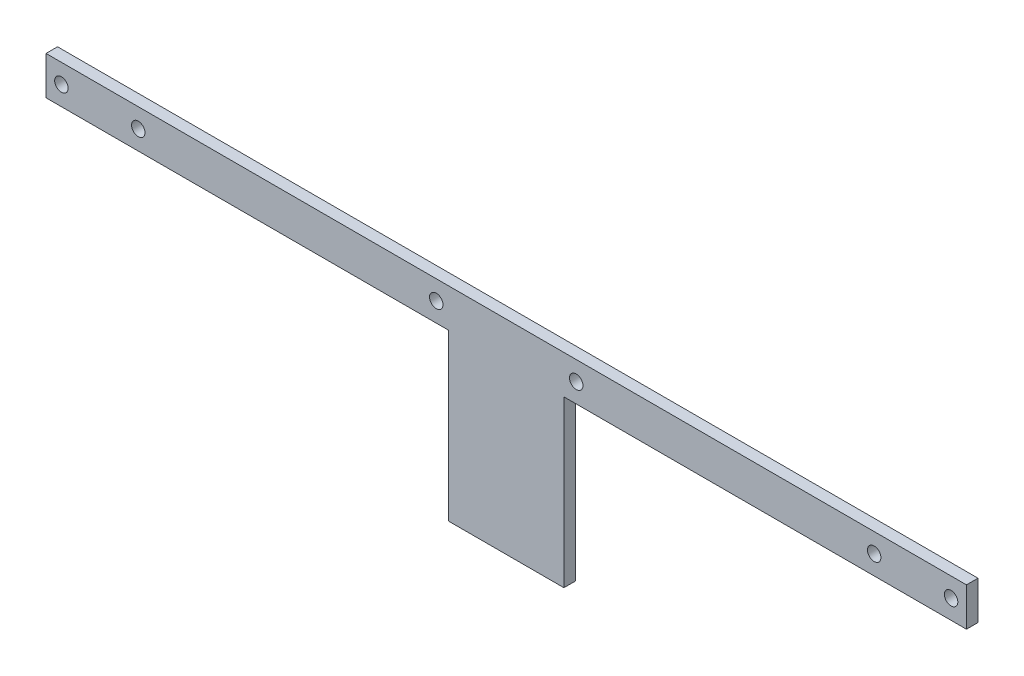
ISO-10303-21;
HEADER;
FILE_DESCRIPTION(('STEP AP214'),'2;1');
FILE_NAME('part.step','',(''),(''),'','','');
FILE_SCHEMA(('AUTOMOTIVE_DESIGN { 1 0 10303 214 1 1 1 1 }'));
ENDSEC;
DATA;
#1=APPLICATION_CONTEXT('core data for automotive mechanical design processes');
#2=APPLICATION_PROTOCOL_DEFINITION('international standard','automotive_design',2000,#1);
#3=PRODUCT_CONTEXT('',#1,'mechanical');
#4=PRODUCT('Part','Part','',(#3));
#5=PRODUCT_RELATED_PRODUCT_CATEGORY('part','',(#4));
#6=PRODUCT_DEFINITION_FORMATION('','',#4);
#7=PRODUCT_DEFINITION_CONTEXT('part definition',#1,'design');
#8=PRODUCT_DEFINITION('design','',#6,#7);
#9=PRODUCT_DEFINITION_SHAPE('','',#8);
#10=(LENGTH_UNIT() NAMED_UNIT(*) SI_UNIT(.MILLI.,.METRE.));
#11=(NAMED_UNIT(*) PLANE_ANGLE_UNIT() SI_UNIT($,.RADIAN.));
#12=(NAMED_UNIT(*) SI_UNIT($,.STERADIAN.) SOLID_ANGLE_UNIT());
#13=UNCERTAINTY_MEASURE_WITH_UNIT(LENGTH_MEASURE(1.E-05),#10,'distance_accuracy_value','');
#14=(GEOMETRIC_REPRESENTATION_CONTEXT(3) GLOBAL_UNCERTAINTY_ASSIGNED_CONTEXT((#13)) GLOBAL_UNIT_ASSIGNED_CONTEXT((#10,
#11,#12)) REPRESENTATION_CONTEXT('',''));
#15=CARTESIAN_POINT('',(0.,0.,0.));
#16=DIRECTION('',(0.,0.,1.));
#17=DIRECTION('',(1.,0.,0.));
#18=AXIS2_PLACEMENT_3D('',#15,#16,#17);
#19=CARTESIAN_POINT('',(0.,0.,3.));
#20=DIRECTION('',(0.,0.,-1.));
#21=DIRECTION('',(-1.,0.,0.));
#22=AXIS2_PLACEMENT_3D('',#19,#20,#21);
#23=PLANE('',#22);
#24=DIRECTION('',(1.,0.,0.));
#25=VECTOR('',#24,1.);
#26=CARTESIAN_POINT('',(104.7,0.,3.));
#27=LINE('',#26,#25);
#28=CARTESIAN_POINT('',(0.,0.,3.));
#29=VERTEX_POINT('',#28);
#30=CARTESIAN_POINT('',(104.7,0.,3.));
#31=VERTEX_POINT('',#30);
#32=EDGE_CURVE('E151',#29,#31,#27,.T.);
#33=ORIENTED_EDGE('',*,*,#32,.T.);
#34=DIRECTION('',(0.,-1.,0.));
#35=VECTOR('',#34,1.);
#36=CARTESIAN_POINT('',(104.7,-43.,3.));
#37=LINE('',#36,#35);
#38=CARTESIAN_POINT('',(104.7,-43.,3.));
#39=VERTEX_POINT('',#38);
#40=EDGE_CURVE('E99',#31,#39,#37,.T.);
#41=ORIENTED_EDGE('',*,*,#40,.T.);
#42=DIRECTION('',(1.,0.,0.));
#43=VECTOR('',#42,1.);
#44=CARTESIAN_POINT('',(104.7,-43.,3.));
#45=LINE('',#44,#43);
#46=CARTESIAN_POINT('',(134.7,-43.,3.));
#47=VERTEX_POINT('',#46);
#48=EDGE_CURVE('E166',#39,#47,#45,.T.);
#49=ORIENTED_EDGE('',*,*,#48,.T.);
#50=DIRECTION('',(0.,1.,0.));
#51=VECTOR('',#50,1.);
#52=CARTESIAN_POINT('',(134.7,0.,3.));
#53=LINE('',#52,#51);
#54=CARTESIAN_POINT('',(134.7,0.,3.));
#55=VERTEX_POINT('',#54);
#56=EDGE_CURVE('E179',#47,#55,#53,.T.);
#57=ORIENTED_EDGE('',*,*,#56,.T.);
#58=DIRECTION('',(1.,0.,0.));
#59=VECTOR('',#58,1.);
#60=CARTESIAN_POINT('',(134.7,0.,3.));
#61=LINE('',#60,#59);
#62=CARTESIAN_POINT('',(239.4,0.,3.));
#63=VERTEX_POINT('',#62);
#64=EDGE_CURVE('E118',#55,#63,#61,.T.);
#65=ORIENTED_EDGE('',*,*,#64,.T.);
#66=DIRECTION('',(0.,1.,0.));
#67=VECTOR('',#66,1.);
#68=CARTESIAN_POINT('',(239.4,0.,3.));
#69=LINE('',#68,#67);
#70=CARTESIAN_POINT('',(239.4,10.,3.));
#71=VERTEX_POINT('',#70);
#72=EDGE_CURVE('E112',#63,#71,#69,.T.);
#73=ORIENTED_EDGE('',*,*,#72,.T.);
#74=DIRECTION('',(-1.,0.,0.));
#75=VECTOR('',#74,1.);
#76=CARTESIAN_POINT('',(0.,9.99999999999999,3.));
#77=LINE('',#76,#75);
#78=CARTESIAN_POINT('',(0.,9.99999999999999,3.));
#79=VERTEX_POINT('',#78);
#80=EDGE_CURVE('E116',#71,#79,#77,.T.);
#81=ORIENTED_EDGE('',*,*,#80,.T.);
#82=DIRECTION('',(0.,-1.,0.));
#83=VECTOR('',#82,1.);
#84=CARTESIAN_POINT('',(0.,0.,3.));
#85=LINE('',#84,#83);
#86=EDGE_CURVE('E56',#79,#29,#85,.T.);
#87=ORIENTED_EDGE('',*,*,#86,.T.);
#88=EDGE_LOOP('',(#33,#41,#49,#57,#65,#73,#81,#87));
#89=FACE_BOUND('',#88,.T.);
#90=CARTESIAN_POINT('',(4.,5.,3.));
#91=DIRECTION('',(0.,0.,1.));
#92=DIRECTION('',(1.,0.,0.));
#93=AXIS2_PLACEMENT_3D('',#90,#91,#92);
#94=CIRCLE('',#93,1.75);
#95=CARTESIAN_POINT('',(5.75,5.,3.));
#96=VERTEX_POINT('',#95);
#97=EDGE_CURVE('E140',#96,#96,#94,.T.);
#98=ORIENTED_EDGE('',*,*,#97,.F.);
#99=EDGE_LOOP('',(#98));
#100=FACE_BOUND('',#99,.T.);
#101=CARTESIAN_POINT('',(24.,5.,3.));
#102=DIRECTION('',(0.,0.,1.));
#103=DIRECTION('',(1.,0.,0.));
#104=AXIS2_PLACEMENT_3D('',#101,#102,#103);
#105=CIRCLE('',#104,1.75);
#106=CARTESIAN_POINT('',(25.75,5.,3.));
#107=VERTEX_POINT('',#106);
#108=EDGE_CURVE('E188',#107,#107,#105,.T.);
#109=ORIENTED_EDGE('',*,*,#108,.F.);
#110=EDGE_LOOP('',(#109));
#111=FACE_BOUND('',#110,.T.);
#112=CARTESIAN_POINT('',(235.4,5.,3.));
#113=DIRECTION('',(0.,0.,1.));
#114=DIRECTION('',(1.,0.,0.));
#115=AXIS2_PLACEMENT_3D('',#112,#113,#114);
#116=CIRCLE('',#115,1.75000000000001);
#117=CARTESIAN_POINT('',(237.15,5.,3.));
#118=VERTEX_POINT('',#117);
#119=EDGE_CURVE('E194',#118,#118,#116,.T.);
#120=ORIENTED_EDGE('',*,*,#119,.F.);
#121=EDGE_LOOP('',(#120));
#122=FACE_BOUND('',#121,.T.);
#123=CARTESIAN_POINT('',(215.4,5.,3.));
#124=DIRECTION('',(0.,0.,1.));
#125=DIRECTION('',(1.,0.,0.));
#126=AXIS2_PLACEMENT_3D('',#123,#124,#125);
#127=CIRCLE('',#126,1.75000000000001);
#128=CARTESIAN_POINT('',(217.15,5.,3.));
#129=VERTEX_POINT('',#128);
#130=EDGE_CURVE('E200',#129,#129,#127,.T.);
#131=ORIENTED_EDGE('',*,*,#130,.F.);
#132=EDGE_LOOP('',(#131));
#133=FACE_BOUND('',#132,.T.);
#134=CARTESIAN_POINT('',(101.5,5.,3.));
#135=DIRECTION('',(0.,0.,1.));
#136=DIRECTION('',(1.,0.,0.));
#137=AXIS2_PLACEMENT_3D('',#134,#135,#136);
#138=CIRCLE('',#137,1.75);
#139=CARTESIAN_POINT('',(103.25,5.,3.));
#140=VERTEX_POINT('',#139);
#141=EDGE_CURVE('E206',#140,#140,#138,.T.);
#142=ORIENTED_EDGE('',*,*,#141,.F.);
#143=EDGE_LOOP('',(#142));
#144=FACE_BOUND('',#143,.T.);
#145=CARTESIAN_POINT('',(137.9,5.,3.));
#146=DIRECTION('',(0.,0.,1.));
#147=DIRECTION('',(1.,0.,0.));
#148=AXIS2_PLACEMENT_3D('',#145,#146,#147);
#149=CIRCLE('',#148,1.75000000000001);
#150=CARTESIAN_POINT('',(139.65,5.,3.));
#151=VERTEX_POINT('',#150);
#152=EDGE_CURVE('E212',#151,#151,#149,.T.);
#153=ORIENTED_EDGE('',*,*,#152,.F.);
#154=EDGE_LOOP('',(#153));
#155=FACE_BOUND('',#154,.T.);
#156=ADVANCED_FACE('F39',(#89,#100,#111,#122,#133,#144,#155),#23,.F.);
#157=CARTESIAN_POINT('',(0.,0.,0.));
#158=DIRECTION('',(0.,0.,-1.));
#159=DIRECTION('',(-1.,0.,0.));
#160=AXIS2_PLACEMENT_3D('',#157,#158,#159);
#161=PLANE('',#160);
#162=CARTESIAN_POINT('',(101.5,5.,0.));
#163=DIRECTION('',(0.,0.,1.));
#164=DIRECTION('',(1.,0.,0.));
#165=AXIS2_PLACEMENT_3D('',#162,#163,#164);
#166=CIRCLE('',#165,1.75);
#167=CARTESIAN_POINT('',(103.25,5.,0.));
#168=VERTEX_POINT('',#167);
#169=EDGE_CURVE('E209',#168,#168,#166,.T.);
#170=ORIENTED_EDGE('',*,*,#169,.T.);
#171=EDGE_LOOP('',(#170));
#172=FACE_BOUND('',#171,.T.);
#173=CARTESIAN_POINT('',(235.4,5.,0.));
#174=DIRECTION('',(0.,0.,1.));
#175=DIRECTION('',(1.,0.,0.));
#176=AXIS2_PLACEMENT_3D('',#173,#174,#175);
#177=CIRCLE('',#176,1.75000000000001);
#178=CARTESIAN_POINT('',(237.15,5.,0.));
#179=VERTEX_POINT('',#178);
#180=EDGE_CURVE('E197',#179,#179,#177,.T.);
#181=ORIENTED_EDGE('',*,*,#180,.T.);
#182=EDGE_LOOP('',(#181));
#183=FACE_BOUND('',#182,.T.);
#184=CARTESIAN_POINT('',(4.,5.,0.));
#185=DIRECTION('',(0.,0.,1.));
#186=DIRECTION('',(1.,0.,0.));
#187=AXIS2_PLACEMENT_3D('',#184,#185,#186);
#188=CIRCLE('',#187,1.75);
#189=CARTESIAN_POINT('',(5.75,5.,0.));
#190=VERTEX_POINT('',#189);
#191=EDGE_CURVE('E185',#190,#190,#188,.T.);
#192=ORIENTED_EDGE('',*,*,#191,.T.);
#193=EDGE_LOOP('',(#192));
#194=FACE_BOUND('',#193,.T.);
#195=DIRECTION('',(1.,0.,0.));
#196=VECTOR('',#195,1.);
#197=CARTESIAN_POINT('',(104.7,0.,0.));
#198=LINE('',#197,#196);
#199=CARTESIAN_POINT('',(0.,0.,0.));
#200=VERTEX_POINT('',#199);
#201=CARTESIAN_POINT('',(104.7,0.,0.));
#202=VERTEX_POINT('',#201);
#203=EDGE_CURVE('E136',#200,#202,#198,.T.);
#204=ORIENTED_EDGE('',*,*,#203,.F.);
#205=DIRECTION('',(0.,-1.,0.));
#206=VECTOR('',#205,1.);
#207=CARTESIAN_POINT('',(0.,0.,0.));
#208=LINE('',#207,#206);
#209=CARTESIAN_POINT('',(0.,9.99999999999999,0.));
#210=VERTEX_POINT('',#209);
#211=EDGE_CURVE('E91',#210,#200,#208,.T.);
#212=ORIENTED_EDGE('',*,*,#211,.F.);
#213=DIRECTION('',(-1.,0.,0.));
#214=VECTOR('',#213,1.);
#215=CARTESIAN_POINT('',(0.,9.99999999999999,0.));
#216=LINE('',#215,#214);
#217=CARTESIAN_POINT('',(239.4,10.,0.));
#218=VERTEX_POINT('',#217);
#219=EDGE_CURVE('E85',#218,#210,#216,.T.);
#220=ORIENTED_EDGE('',*,*,#219,.F.);
#221=DIRECTION('',(0.,1.,0.));
#222=VECTOR('',#221,1.);
#223=CARTESIAN_POINT('',(239.4,0.,0.));
#224=LINE('',#223,#222);
#225=CARTESIAN_POINT('',(239.4,0.,0.));
#226=VERTEX_POINT('',#225);
#227=EDGE_CURVE('E126',#226,#218,#224,.T.);
#228=ORIENTED_EDGE('',*,*,#227,.F.);
#229=DIRECTION('',(1.,0.,0.));
#230=VECTOR('',#229,1.);
#231=CARTESIAN_POINT('',(134.7,0.,0.));
#232=LINE('',#231,#230);
#233=CARTESIAN_POINT('',(134.7,0.,0.));
#234=VERTEX_POINT('',#233);
#235=EDGE_CURVE('E146',#234,#226,#232,.T.);
#236=ORIENTED_EDGE('',*,*,#235,.F.);
#237=DIRECTION('',(0.,1.,0.));
#238=VECTOR('',#237,1.);
#239=CARTESIAN_POINT('',(134.7,0.,0.));
#240=LINE('',#239,#238);
#241=CARTESIAN_POINT('',(134.7,-43.,0.));
#242=VERTEX_POINT('',#241);
#243=EDGE_CURVE('E144',#242,#234,#240,.T.);
#244=ORIENTED_EDGE('',*,*,#243,.F.);
#245=DIRECTION('',(1.,0.,0.));
#246=VECTOR('',#245,1.);
#247=CARTESIAN_POINT('',(104.7,-43.,0.));
#248=LINE('',#247,#246);
#249=CARTESIAN_POINT('',(104.7,-43.,0.));
#250=VERTEX_POINT('',#249);
#251=EDGE_CURVE('E142',#250,#242,#248,.T.);
#252=ORIENTED_EDGE('',*,*,#251,.F.);
#253=DIRECTION('',(0.,-1.,0.));
#254=VECTOR('',#253,1.);
#255=CARTESIAN_POINT('',(104.7,-43.,0.));
#256=LINE('',#255,#254);
#257=EDGE_CURVE('E139',#202,#250,#256,.T.);
#258=ORIENTED_EDGE('',*,*,#257,.F.);
#259=EDGE_LOOP('',(#204,#212,#220,#228,#236,#244,#252,#258));
#260=FACE_BOUND('',#259,.T.);
#261=CARTESIAN_POINT('',(24.,5.,0.));
#262=DIRECTION('',(0.,0.,1.));
#263=DIRECTION('',(1.,0.,0.));
#264=AXIS2_PLACEMENT_3D('',#261,#262,#263);
#265=CIRCLE('',#264,1.75);
#266=CARTESIAN_POINT('',(25.75,5.,0.));
#267=VERTEX_POINT('',#266);
#268=EDGE_CURVE('E191',#267,#267,#265,.T.);
#269=ORIENTED_EDGE('',*,*,#268,.T.);
#270=EDGE_LOOP('',(#269));
#271=FACE_BOUND('',#270,.T.);
#272=CARTESIAN_POINT('',(215.4,5.,0.));
#273=DIRECTION('',(0.,0.,1.));
#274=DIRECTION('',(1.,0.,0.));
#275=AXIS2_PLACEMENT_3D('',#272,#273,#274);
#276=CIRCLE('',#275,1.75000000000001);
#277=CARTESIAN_POINT('',(217.15,5.,0.));
#278=VERTEX_POINT('',#277);
#279=EDGE_CURVE('E203',#278,#278,#276,.T.);
#280=ORIENTED_EDGE('',*,*,#279,.T.);
#281=EDGE_LOOP('',(#280));
#282=FACE_BOUND('',#281,.T.);
#283=CARTESIAN_POINT('',(137.9,5.,0.));
#284=DIRECTION('',(0.,0.,1.));
#285=DIRECTION('',(1.,0.,0.));
#286=AXIS2_PLACEMENT_3D('',#283,#284,#285);
#287=CIRCLE('',#286,1.75000000000001);
#288=CARTESIAN_POINT('',(139.65,5.,0.));
#289=VERTEX_POINT('',#288);
#290=EDGE_CURVE('E215',#289,#289,#287,.T.);
#291=ORIENTED_EDGE('',*,*,#290,.T.);
#292=EDGE_LOOP('',(#291));
#293=FACE_BOUND('',#292,.T.);
#294=ADVANCED_FACE('F170',(#172,#183,#194,#260,#271,#282,#293),#161,.T.);
#295=CARTESIAN_POINT('',(104.7,0.,3.));
#296=DIRECTION('',(0.,1.,0.));
#297=DIRECTION('',(-1.,0.,0.));
#298=AXIS2_PLACEMENT_3D('',#295,#296,#297);
#299=PLANE('',#298);
#300=ORIENTED_EDGE('',*,*,#203,.T.);
#301=DIRECTION('',(0.,0.,-1.));
#302=VECTOR('',#301,1.);
#303=CARTESIAN_POINT('',(104.7,0.,3.));
#304=LINE('',#303,#302);
#305=EDGE_CURVE('E11',#31,#202,#304,.T.);
#306=ORIENTED_EDGE('',*,*,#305,.F.);
#307=ORIENTED_EDGE('',*,*,#32,.F.);
#308=DIRECTION('',(0.,0.,-1.));
#309=VECTOR('',#308,1.);
#310=CARTESIAN_POINT('',(0.,0.,3.));
#311=LINE('',#310,#309);
#312=EDGE_CURVE('E132',#29,#200,#311,.T.);
#313=ORIENTED_EDGE('',*,*,#312,.T.);
#314=EDGE_LOOP('',(#300,#306,#307,#313));
#315=FACE_BOUND('',#314,.T.);
#316=ADVANCED_FACE('F41',(#315),#299,.F.);
#317=CARTESIAN_POINT('',(104.7,-43.,3.));
#318=DIRECTION('',(1.,0.,0.));
#319=DIRECTION('',(0.,1.,0.));
#320=AXIS2_PLACEMENT_3D('',#317,#318,#319);
#321=PLANE('',#320);
#322=ORIENTED_EDGE('',*,*,#257,.T.);
#323=DIRECTION('',(0.,0.,-1.));
#324=VECTOR('',#323,1.);
#325=CARTESIAN_POINT('',(104.7,-43.,3.));
#326=LINE('',#325,#324);
#327=EDGE_CURVE('E48',#39,#250,#326,.T.);
#328=ORIENTED_EDGE('',*,*,#327,.F.);
#329=ORIENTED_EDGE('',*,*,#40,.F.);
#330=ORIENTED_EDGE('',*,*,#305,.T.);
#331=EDGE_LOOP('',(#322,#328,#329,#330));
#332=FACE_BOUND('',#331,.T.);
#333=ADVANCED_FACE('F247',(#332),#321,.F.);
#334=CARTESIAN_POINT('',(104.7,-43.,3.));
#335=DIRECTION('',(0.,1.,0.));
#336=DIRECTION('',(-1.,0.,0.));
#337=AXIS2_PLACEMENT_3D('',#334,#335,#336);
#338=PLANE('',#337);
#339=ORIENTED_EDGE('',*,*,#251,.T.);
#340=DIRECTION('',(0.,0.,-1.));
#341=VECTOR('',#340,1.);
#342=CARTESIAN_POINT('',(134.7,-43.,3.));
#343=LINE('',#342,#341);
#344=EDGE_CURVE('E158',#47,#242,#343,.T.);
#345=ORIENTED_EDGE('',*,*,#344,.F.);
#346=ORIENTED_EDGE('',*,*,#48,.F.);
#347=ORIENTED_EDGE('',*,*,#327,.T.);
#348=EDGE_LOOP('',(#339,#345,#346,#347));
#349=FACE_BOUND('',#348,.T.);
#350=ADVANCED_FACE('F164',(#349),#338,.F.);
#351=CARTESIAN_POINT('',(134.7,0.,3.));
#352=DIRECTION('',(-1.,0.,0.));
#353=DIRECTION('',(0.,-1.,0.));
#354=AXIS2_PLACEMENT_3D('',#351,#352,#353);
#355=PLANE('',#354);
#356=ORIENTED_EDGE('',*,*,#243,.T.);
#357=DIRECTION('',(0.,0.,-1.));
#358=VECTOR('',#357,1.);
#359=CARTESIAN_POINT('',(134.7,0.,3.));
#360=LINE('',#359,#358);
#361=EDGE_CURVE('E155',#55,#234,#360,.T.);
#362=ORIENTED_EDGE('',*,*,#361,.F.);
#363=ORIENTED_EDGE('',*,*,#56,.F.);
#364=ORIENTED_EDGE('',*,*,#344,.T.);
#365=EDGE_LOOP('',(#356,#362,#363,#364));
#366=FACE_BOUND('',#365,.T.);
#367=ADVANCED_FACE('F175',(#366),#355,.F.);
#368=CARTESIAN_POINT('',(134.7,0.,3.));
#369=DIRECTION('',(0.,1.,0.));
#370=DIRECTION('',(-1.,0.,0.));
#371=AXIS2_PLACEMENT_3D('',#368,#369,#370);
#372=PLANE('',#371);
#373=ORIENTED_EDGE('',*,*,#235,.T.);
#374=DIRECTION('',(0.,0.,-1.));
#375=VECTOR('',#374,1.);
#376=CARTESIAN_POINT('',(239.4,0.,3.));
#377=LINE('',#376,#375);
#378=EDGE_CURVE('E127',#63,#226,#377,.T.);
#379=ORIENTED_EDGE('',*,*,#378,.F.);
#380=ORIENTED_EDGE('',*,*,#64,.F.);
#381=ORIENTED_EDGE('',*,*,#361,.T.);
#382=EDGE_LOOP('',(#373,#379,#380,#381));
#383=FACE_BOUND('',#382,.T.);
#384=ADVANCED_FACE('F178',(#383),#372,.F.);
#385=CARTESIAN_POINT('',(239.4,0.,3.));
#386=DIRECTION('',(-1.,0.,0.));
#387=DIRECTION('',(0.,0.,1.));
#388=AXIS2_PLACEMENT_3D('',#385,#386,#387);
#389=PLANE('',#388);
#390=ORIENTED_EDGE('',*,*,#227,.T.);
#391=DIRECTION('',(0.,0.,-1.));
#392=VECTOR('',#391,1.);
#393=CARTESIAN_POINT('',(239.4,10.,3.));
#394=LINE('',#393,#392);
#395=EDGE_CURVE('E123',#71,#218,#394,.T.);
#396=ORIENTED_EDGE('',*,*,#395,.F.);
#397=ORIENTED_EDGE('',*,*,#72,.F.);
#398=ORIENTED_EDGE('',*,*,#378,.T.);
#399=EDGE_LOOP('',(#390,#396,#397,#398));
#400=FACE_BOUND('',#399,.T.);
#401=ADVANCED_FACE('F124',(#400),#389,.F.);
#402=CARTESIAN_POINT('',(0.,9.99999999999999,3.));
#403=DIRECTION('',(0.,-1.,0.));
#404=DIRECTION('',(1.,0.,0.));
#405=AXIS2_PLACEMENT_3D('',#402,#403,#404);
#406=PLANE('',#405);
#407=ORIENTED_EDGE('',*,*,#219,.T.);
#408=DIRECTION('',(0.,0.,-1.));
#409=VECTOR('',#408,1.);
#410=CARTESIAN_POINT('',(0.,9.99999999999999,3.));
#411=LINE('',#410,#409);
#412=EDGE_CURVE('E128',#79,#210,#411,.T.);
#413=ORIENTED_EDGE('',*,*,#412,.F.);
#414=ORIENTED_EDGE('',*,*,#80,.F.);
#415=ORIENTED_EDGE('',*,*,#395,.T.);
#416=EDGE_LOOP('',(#407,#413,#414,#415));
#417=FACE_BOUND('',#416,.T.);
#418=ADVANCED_FACE('F130',(#417),#406,.F.);
#419=CARTESIAN_POINT('',(0.,0.,3.));
#420=DIRECTION('',(1.,0.,0.));
#421=DIRECTION('',(0.,0.,-1.));
#422=AXIS2_PLACEMENT_3D('',#419,#420,#421);
#423=PLANE('',#422);
#424=ORIENTED_EDGE('',*,*,#211,.T.);
#425=ORIENTED_EDGE('',*,*,#312,.F.);
#426=ORIENTED_EDGE('',*,*,#86,.F.);
#427=ORIENTED_EDGE('',*,*,#412,.T.);
#428=EDGE_LOOP('',(#424,#425,#426,#427));
#429=FACE_BOUND('',#428,.T.);
#430=ADVANCED_FACE('F235',(#429),#423,.F.);
#431=CARTESIAN_POINT('',(4.,5.,3.));
#432=DIRECTION('',(0.,0.,-1.));
#433=DIRECTION('',(-1.,0.,0.));
#434=AXIS2_PLACEMENT_3D('',#431,#432,#433);
#435=CYLINDRICAL_SURFACE('',#434,1.75);
#436=ORIENTED_EDGE('',*,*,#97,.T.);
#437=EDGE_LOOP('',(#436));
#438=FACE_BOUND('',#437,.T.);
#439=ORIENTED_EDGE('',*,*,#191,.F.);
#440=EDGE_LOOP('',(#439));
#441=FACE_BOUND('',#440,.T.);
#442=ADVANCED_FACE('F232',(#438,#441),#435,.F.);
#443=CARTESIAN_POINT('',(24.,5.,3.));
#444=DIRECTION('',(0.,0.,-1.));
#445=DIRECTION('',(-1.,0.,0.));
#446=AXIS2_PLACEMENT_3D('',#443,#444,#445);
#447=CYLINDRICAL_SURFACE('',#446,1.75);
#448=ORIENTED_EDGE('',*,*,#108,.T.);
#449=EDGE_LOOP('',(#448));
#450=FACE_BOUND('',#449,.T.);
#451=ORIENTED_EDGE('',*,*,#268,.F.);
#452=EDGE_LOOP('',(#451));
#453=FACE_BOUND('',#452,.T.);
#454=ADVANCED_FACE('F310',(#450,#453),#447,.F.);
#455=CARTESIAN_POINT('',(235.4,5.,3.));
#456=DIRECTION('',(0.,0.,-1.));
#457=DIRECTION('',(-1.,0.,0.));
#458=AXIS2_PLACEMENT_3D('',#455,#456,#457);
#459=CYLINDRICAL_SURFACE('',#458,1.75000000000001);
#460=ORIENTED_EDGE('',*,*,#119,.T.);
#461=EDGE_LOOP('',(#460));
#462=FACE_BOUND('',#461,.T.);
#463=ORIENTED_EDGE('',*,*,#180,.F.);
#464=EDGE_LOOP('',(#463));
#465=FACE_BOUND('',#464,.T.);
#466=ADVANCED_FACE('F318',(#462,#465),#459,.F.);
#467=CARTESIAN_POINT('',(215.4,5.,3.));
#468=DIRECTION('',(0.,0.,-1.));
#469=DIRECTION('',(-1.,0.,0.));
#470=AXIS2_PLACEMENT_3D('',#467,#468,#469);
#471=CYLINDRICAL_SURFACE('',#470,1.75000000000001);
#472=ORIENTED_EDGE('',*,*,#130,.T.);
#473=EDGE_LOOP('',(#472));
#474=FACE_BOUND('',#473,.T.);
#475=ORIENTED_EDGE('',*,*,#279,.F.);
#476=EDGE_LOOP('',(#475));
#477=FACE_BOUND('',#476,.T.);
#478=ADVANCED_FACE('F326',(#474,#477),#471,.F.);
#479=CARTESIAN_POINT('',(101.5,5.,3.));
#480=DIRECTION('',(0.,0.,-1.));
#481=DIRECTION('',(-1.,0.,0.));
#482=AXIS2_PLACEMENT_3D('',#479,#480,#481);
#483=CYLINDRICAL_SURFACE('',#482,1.75);
#484=ORIENTED_EDGE('',*,*,#141,.T.);
#485=EDGE_LOOP('',(#484));
#486=FACE_BOUND('',#485,.T.);
#487=ORIENTED_EDGE('',*,*,#169,.F.);
#488=EDGE_LOOP('',(#487));
#489=FACE_BOUND('',#488,.T.);
#490=ADVANCED_FACE('F335',(#486,#489),#483,.F.);
#491=CARTESIAN_POINT('',(137.9,5.,3.));
#492=DIRECTION('',(0.,0.,-1.));
#493=DIRECTION('',(-1.,0.,0.));
#494=AXIS2_PLACEMENT_3D('',#491,#492,#493);
#495=CYLINDRICAL_SURFACE('',#494,1.75000000000001);
#496=ORIENTED_EDGE('',*,*,#152,.T.);
#497=EDGE_LOOP('',(#496));
#498=FACE_BOUND('',#497,.T.);
#499=ORIENTED_EDGE('',*,*,#290,.F.);
#500=EDGE_LOOP('',(#499));
#501=FACE_BOUND('',#500,.T.);
#502=ADVANCED_FACE('F221',(#498,#501),#495,.F.);
#503=CLOSED_SHELL('',(#156,#294,#316,#333,#350,#367,#384,#401,#418,#430,#442,#454,#466,#478,
#490,#502));
#504=MANIFOLD_SOLID_BREP('B2',#503);
#505=ADVANCED_BREP_SHAPE_REPRESENTATION('',(#18,#504),#14);
#506=SHAPE_DEFINITION_REPRESENTATION(#9,#505);
ENDSEC;
END-ISO-10303-21;
